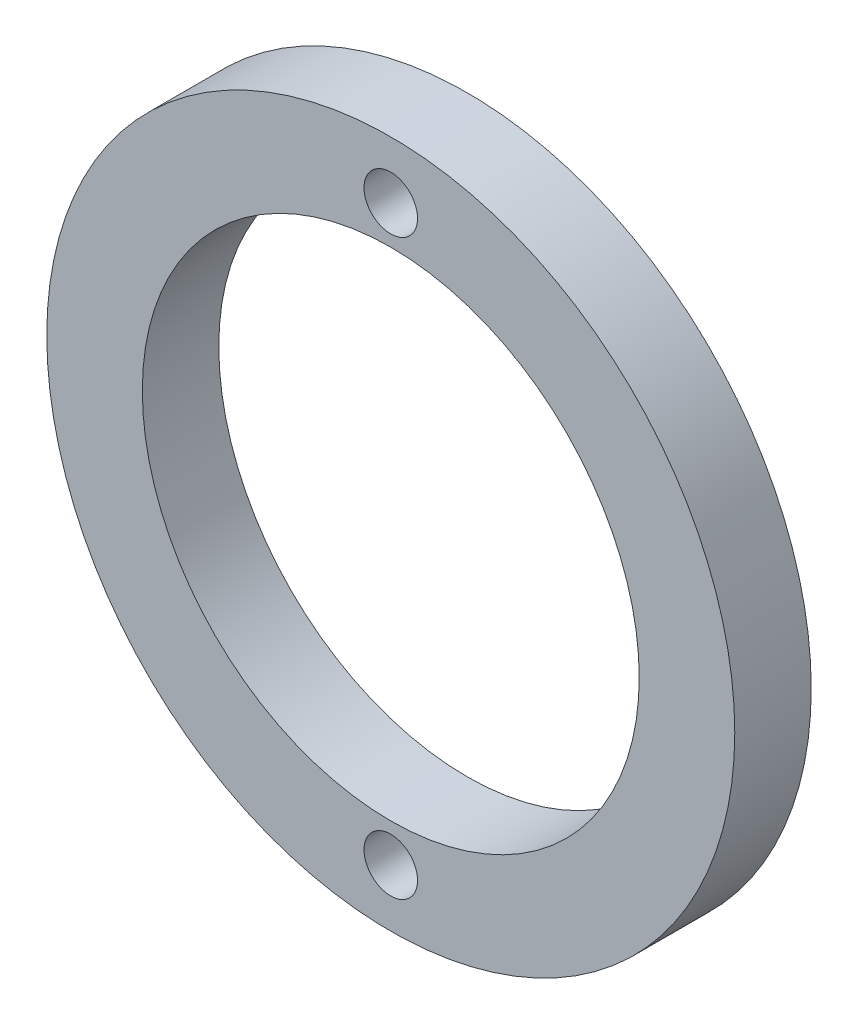
ISO-10303-21;
HEADER;
FILE_DESCRIPTION(('STEP AP214'),'2;1');
FILE_NAME('part.step','',(''),(''),'','','');
FILE_SCHEMA(('AUTOMOTIVE_DESIGN { 1 0 10303 214 1 1 1 1 }'));
ENDSEC;
DATA;
#1=APPLICATION_CONTEXT('core data for automotive mechanical design processes');
#2=APPLICATION_PROTOCOL_DEFINITION('international standard','automotive_design',2000,#1);
#3=PRODUCT_CONTEXT('',#1,'mechanical');
#4=PRODUCT('Part','Part','',(#3));
#5=PRODUCT_RELATED_PRODUCT_CATEGORY('part','',(#4));
#6=PRODUCT_DEFINITION_FORMATION('','',#4);
#7=PRODUCT_DEFINITION_CONTEXT('part definition',#1,'design');
#8=PRODUCT_DEFINITION('design','',#6,#7);
#9=PRODUCT_DEFINITION_SHAPE('','',#8);
#10=(LENGTH_UNIT() NAMED_UNIT(*) SI_UNIT(.MILLI.,.METRE.));
#11=(NAMED_UNIT(*) PLANE_ANGLE_UNIT() SI_UNIT($,.RADIAN.));
#12=(NAMED_UNIT(*) SI_UNIT($,.STERADIAN.) SOLID_ANGLE_UNIT());
#13=UNCERTAINTY_MEASURE_WITH_UNIT(LENGTH_MEASURE(1.E-05),#10,'distance_accuracy_value','');
#14=(GEOMETRIC_REPRESENTATION_CONTEXT(3) GLOBAL_UNCERTAINTY_ASSIGNED_CONTEXT((#13)) GLOBAL_UNIT_ASSIGNED_CONTEXT((#10,
#11,#12)) REPRESENTATION_CONTEXT('',''));
#15=CARTESIAN_POINT('',(0.,0.,0.));
#16=DIRECTION('',(0.,0.,1.));
#17=DIRECTION('',(1.,0.,0.));
#18=AXIS2_PLACEMENT_3D('',#15,#16,#17);
#19=CARTESIAN_POINT('',(0.,0.,2.54));
#20=DIRECTION('',(0.,0.,1.));
#21=DIRECTION('',(1.,0.,0.));
#22=AXIS2_PLACEMENT_3D('',#19,#20,#21);
#23=PLANE('',#22);
#24=CARTESIAN_POINT('',(0.,-9.525,2.54));
#25=DIRECTION('',(0.,0.,1.));
#26=DIRECTION('',(1.,0.,0.));
#27=AXIS2_PLACEMENT_3D('',#24,#25,#26);
#28=CIRCLE('',#27,0.889);
#29=CARTESIAN_POINT('',(0.889,-9.525,2.54));
#30=VERTEX_POINT('',#29);
#31=EDGE_CURVE('E60',#30,#30,#28,.T.);
#32=ORIENTED_EDGE('',*,*,#31,.F.);
#33=EDGE_LOOP('',(#32));
#34=FACE_BOUND('',#33,.T.);
#35=CARTESIAN_POINT('',(0.,9.525,2.54));
#36=DIRECTION('',(0.,0.,1.));
#37=DIRECTION('',(1.,0.,0.));
#38=AXIS2_PLACEMENT_3D('',#35,#36,#37);
#39=CIRCLE('',#38,0.889);
#40=CARTESIAN_POINT('',(0.889,9.525,2.54));
#41=VERTEX_POINT('',#40);
#42=EDGE_CURVE('E54',#41,#41,#39,.T.);
#43=ORIENTED_EDGE('',*,*,#42,.F.);
#44=EDGE_LOOP('',(#43));
#45=FACE_BOUND('',#44,.T.);
#46=CARTESIAN_POINT('',(0.,0.,2.54));
#47=DIRECTION('',(0.,0.,1.));
#48=DIRECTION('',(1.,0.,0.));
#49=AXIS2_PLACEMENT_3D('',#46,#47,#48);
#50=CIRCLE('',#49,11.43);
#51=CARTESIAN_POINT('',(11.43,0.,2.54));
#52=VERTEX_POINT('',#51);
#53=EDGE_CURVE('E10',#52,#52,#50,.T.);
#54=ORIENTED_EDGE('',*,*,#53,.T.);
#55=EDGE_LOOP('',(#54));
#56=FACE_BOUND('',#55,.T.);
#57=CARTESIAN_POINT('',(0.,0.,2.54));
#58=DIRECTION('',(0.,0.,1.));
#59=DIRECTION('',(1.,0.,0.));
#60=AXIS2_PLACEMENT_3D('',#57,#58,#59);
#61=CIRCLE('',#60,8.255);
#62=CARTESIAN_POINT('',(8.255,0.,2.54));
#63=VERTEX_POINT('',#62);
#64=EDGE_CURVE('E44',#63,#63,#61,.T.);
#65=ORIENTED_EDGE('',*,*,#64,.F.);
#66=EDGE_LOOP('',(#65));
#67=FACE_BOUND('',#66,.T.);
#68=ADVANCED_FACE('F33',(#34,#45,#56,#67),#23,.T.);
#69=CARTESIAN_POINT('',(0.,0.,0.));
#70=DIRECTION('',(0.,0.,1.));
#71=DIRECTION('',(1.,0.,0.));
#72=AXIS2_PLACEMENT_3D('',#69,#70,#71);
#73=PLANE('',#72);
#74=CARTESIAN_POINT('',(0.,-9.525,0.));
#75=DIRECTION('',(0.,0.,1.));
#76=DIRECTION('',(1.,0.,0.));
#77=AXIS2_PLACEMENT_3D('',#74,#75,#76);
#78=CIRCLE('',#77,0.888999999999999);
#79=CARTESIAN_POINT('',(0.888999999999999,-9.525,0.));
#80=VERTEX_POINT('',#79);
#81=EDGE_CURVE('E57',#80,#80,#78,.T.);
#82=ORIENTED_EDGE('',*,*,#81,.T.);
#83=EDGE_LOOP('',(#82));
#84=FACE_BOUND('',#83,.T.);
#85=CARTESIAN_POINT('',(0.,9.525,0.));
#86=DIRECTION('',(0.,0.,1.));
#87=DIRECTION('',(1.,0.,0.));
#88=AXIS2_PLACEMENT_3D('',#85,#86,#87);
#89=CIRCLE('',#88,0.888999999999999);
#90=CARTESIAN_POINT('',(0.888999999999999,9.525,0.));
#91=VERTEX_POINT('',#90);
#92=EDGE_CURVE('E49',#91,#91,#89,.T.);
#93=ORIENTED_EDGE('',*,*,#92,.T.);
#94=EDGE_LOOP('',(#93));
#95=FACE_BOUND('',#94,.T.);
#96=CARTESIAN_POINT('',(0.,0.,0.));
#97=DIRECTION('',(0.,0.,1.));
#98=DIRECTION('',(1.,0.,0.));
#99=AXIS2_PLACEMENT_3D('',#96,#97,#98);
#100=CIRCLE('',#99,11.43);
#101=CARTESIAN_POINT('',(11.43,0.,0.));
#102=VERTEX_POINT('',#101);
#103=EDGE_CURVE('E37',#102,#102,#100,.T.);
#104=ORIENTED_EDGE('',*,*,#103,.F.);
#105=EDGE_LOOP('',(#104));
#106=FACE_BOUND('',#105,.T.);
#107=CARTESIAN_POINT('',(0.,0.,0.));
#108=DIRECTION('',(0.,0.,1.));
#109=DIRECTION('',(1.,0.,0.));
#110=AXIS2_PLACEMENT_3D('',#107,#108,#109);
#111=CIRCLE('',#110,8.255);
#112=CARTESIAN_POINT('',(8.255,0.,0.));
#113=VERTEX_POINT('',#112);
#114=EDGE_CURVE('E46',#113,#113,#111,.T.);
#115=ORIENTED_EDGE('',*,*,#114,.T.);
#116=EDGE_LOOP('',(#115));
#117=FACE_BOUND('',#116,.T.);
#118=ADVANCED_FACE('F68',(#84,#95,#106,#117),#73,.F.);
#119=CARTESIAN_POINT('',(0.,0.,2.54));
#120=DIRECTION('',(0.,0.,-1.));
#121=DIRECTION('',(-1.,0.,0.));
#122=AXIS2_PLACEMENT_3D('',#119,#120,#121);
#123=CYLINDRICAL_SURFACE('',#122,11.43);
#124=ORIENTED_EDGE('',*,*,#53,.F.);
#125=EDGE_LOOP('',(#124));
#126=FACE_BOUND('',#125,.T.);
#127=ORIENTED_EDGE('',*,*,#103,.T.);
#128=EDGE_LOOP('',(#127));
#129=FACE_BOUND('',#128,.T.);
#130=ADVANCED_FACE('F35',(#126,#129),#123,.T.);
#131=CARTESIAN_POINT('',(0.,0.,2.54));
#132=DIRECTION('',(0.,0.,-1.));
#133=DIRECTION('',(-1.,0.,0.));
#134=AXIS2_PLACEMENT_3D('',#131,#132,#133);
#135=CYLINDRICAL_SURFACE('',#134,8.255);
#136=ORIENTED_EDGE('',*,*,#64,.T.);
#137=EDGE_LOOP('',(#136));
#138=FACE_BOUND('',#137,.T.);
#139=ORIENTED_EDGE('',*,*,#114,.F.);
#140=EDGE_LOOP('',(#139));
#141=FACE_BOUND('',#140,.T.);
#142=ADVANCED_FACE('F74',(#138,#141),#135,.F.);
#143=CARTESIAN_POINT('',(0.,9.525,2.54));
#144=DIRECTION('',(0.,0.,1.));
#145=DIRECTION('',(1.,0.,0.));
#146=AXIS2_PLACEMENT_3D('',#143,#144,#145);
#147=CYLINDRICAL_SURFACE('',#146,0.888999999999999);
#148=ORIENTED_EDGE('',*,*,#92,.F.);
#149=EDGE_LOOP('',(#148));
#150=FACE_BOUND('',#149,.T.);
#151=ORIENTED_EDGE('',*,*,#42,.T.);
#152=EDGE_LOOP('',(#151));
#153=FACE_BOUND('',#152,.T.);
#154=ADVANCED_FACE('F77',(#150,#153),#147,.F.);
#155=CARTESIAN_POINT('',(0.,-9.525,2.54));
#156=DIRECTION('',(0.,0.,1.));
#157=DIRECTION('',(1.,0.,0.));
#158=AXIS2_PLACEMENT_3D('',#155,#156,#157);
#159=CYLINDRICAL_SURFACE('',#158,0.888999999999999);
#160=ORIENTED_EDGE('',*,*,#81,.F.);
#161=EDGE_LOOP('',(#160));
#162=FACE_BOUND('',#161,.T.);
#163=ORIENTED_EDGE('',*,*,#31,.T.);
#164=EDGE_LOOP('',(#163));
#165=FACE_BOUND('',#164,.T.);
#166=ADVANCED_FACE('F64',(#162,#165),#159,.F.);
#167=CLOSED_SHELL('',(#68,#118,#130,#142,#154,#166));
#168=MANIFOLD_SOLID_BREP('B2',#167);
#169=ADVANCED_BREP_SHAPE_REPRESENTATION('',(#18,#168),#14);
#170=SHAPE_DEFINITION_REPRESENTATION(#9,#169);
ENDSEC;
END-ISO-10303-21;
